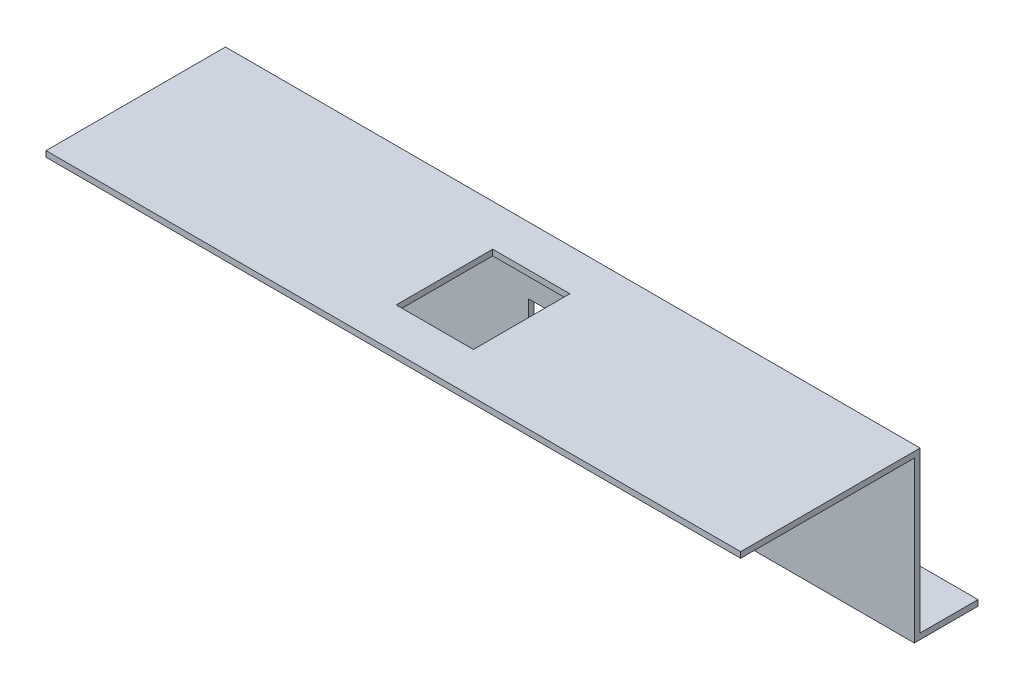
ISO-10303-21;
HEADER;
FILE_DESCRIPTION(('STEP AP214'),'2;1');
FILE_NAME('part.step','',(''),(''),'','','');
FILE_SCHEMA(('AUTOMOTIVE_DESIGN { 1 0 10303 214 1 1 1 1 }'));
ENDSEC;
DATA;
#1=APPLICATION_CONTEXT('core data for automotive mechanical design processes');
#2=APPLICATION_PROTOCOL_DEFINITION('international standard','automotive_design',2000,#1);
#3=PRODUCT_CONTEXT('',#1,'mechanical');
#4=PRODUCT('Part','Part','',(#3));
#5=PRODUCT_RELATED_PRODUCT_CATEGORY('part','',(#4));
#6=PRODUCT_DEFINITION_FORMATION('','',#4);
#7=PRODUCT_DEFINITION_CONTEXT('part definition',#1,'design');
#8=PRODUCT_DEFINITION('design','',#6,#7);
#9=PRODUCT_DEFINITION_SHAPE('','',#8);
#10=(LENGTH_UNIT() NAMED_UNIT(*) SI_UNIT(.MILLI.,.METRE.));
#11=(NAMED_UNIT(*) PLANE_ANGLE_UNIT() SI_UNIT($,.RADIAN.));
#12=(NAMED_UNIT(*) SI_UNIT($,.STERADIAN.) SOLID_ANGLE_UNIT());
#13=UNCERTAINTY_MEASURE_WITH_UNIT(LENGTH_MEASURE(1.E-05),#10,'distance_accuracy_value','');
#14=(GEOMETRIC_REPRESENTATION_CONTEXT(3) GLOBAL_UNCERTAINTY_ASSIGNED_CONTEXT((#13)) GLOBAL_UNIT_ASSIGNED_CONTEXT((#10,
#11,#12)) REPRESENTATION_CONTEXT('',''));
#15=CARTESIAN_POINT('',(0.,0.,0.));
#16=DIRECTION('',(0.,0.,1.));
#17=DIRECTION('',(1.,0.,0.));
#18=AXIS2_PLACEMENT_3D('',#15,#16,#17);
#19=CARTESIAN_POINT('',(180.,40.,45.75));
#20=DIRECTION('',(0.,0.,-1.));
#21=DIRECTION('',(-1.,0.,0.));
#22=AXIS2_PLACEMENT_3D('',#19,#20,#21);
#23=PLANE('',#22);
#24=DIRECTION('',(0.,-1.,0.));
#25=VECTOR('',#24,1.);
#26=CARTESIAN_POINT('',(0.,40.,45.75));
#27=LINE('',#26,#25);
#28=CARTESIAN_POINT('',(0.,41.5,45.75));
#29=VERTEX_POINT('',#28);
#30=CARTESIAN_POINT('',(0.,40.,45.75));
#31=VERTEX_POINT('',#30);
#32=EDGE_CURVE('E243',#29,#31,#27,.T.);
#33=ORIENTED_EDGE('',*,*,#32,.T.);
#34=DIRECTION('',(-1.,0.,0.));
#35=VECTOR('',#34,1.);
#36=CARTESIAN_POINT('',(180.,40.,45.75));
#37=LINE('',#36,#35);
#38=CARTESIAN_POINT('',(180.,40.,45.75));
#39=VERTEX_POINT('',#38);
#40=EDGE_CURVE('E11',#39,#31,#37,.T.);
#41=ORIENTED_EDGE('',*,*,#40,.F.);
#42=DIRECTION('',(0.,-1.,0.));
#43=VECTOR('',#42,1.);
#44=CARTESIAN_POINT('',(180.,40.,45.75));
#45=LINE('',#44,#43);
#46=CARTESIAN_POINT('',(180.,41.5,45.75));
#47=VERTEX_POINT('',#46);
#48=EDGE_CURVE('E244',#47,#39,#45,.T.);
#49=ORIENTED_EDGE('',*,*,#48,.F.);
#50=DIRECTION('',(-1.,0.,0.));
#51=VECTOR('',#50,1.);
#52=CARTESIAN_POINT('',(180.,41.5,45.75));
#53=LINE('',#52,#51);
#54=EDGE_CURVE('E262',#47,#29,#53,.T.);
#55=ORIENTED_EDGE('',*,*,#54,.T.);
#56=EDGE_LOOP('',(#33,#41,#49,#55));
#57=FACE_BOUND('',#56,.T.);
#58=ADVANCED_FACE('F32',(#57),#23,.F.);
#59=CARTESIAN_POINT('',(180.,40.,0.750000000000001));
#60=DIRECTION('',(0.,1.,0.));
#61=DIRECTION('',(0.,0.,1.));
#62=AXIS2_PLACEMENT_3D('',#59,#60,#61);
#63=PLANE('',#62);
#64=DIRECTION('',(1.,0.,0.));
#65=VECTOR('',#64,1.);
#66=CARTESIAN_POINT('',(180.,40.,35.));
#67=LINE('',#66,#65);
#68=CARTESIAN_POINT('',(80.,40.,35.));
#69=VERTEX_POINT('',#68);
#70=CARTESIAN_POINT('',(100.,40.,35.));
#71=VERTEX_POINT('',#70);
#72=EDGE_CURVE('E175',#69,#71,#67,.T.);
#73=ORIENTED_EDGE('',*,*,#72,.T.);
#74=DIRECTION('',(0.,0.,-1.));
#75=VECTOR('',#74,1.);
#76=CARTESIAN_POINT('',(100.,40.,0.750000000000001));
#77=LINE('',#76,#75);
#78=CARTESIAN_POINT('',(100.,40.,9.99999999999997));
#79=VERTEX_POINT('',#78);
#80=EDGE_CURVE('E178',#71,#79,#77,.T.);
#81=ORIENTED_EDGE('',*,*,#80,.T.);
#82=DIRECTION('',(-1.,0.,0.));
#83=VECTOR('',#82,1.);
#84=CARTESIAN_POINT('',(180.,40.,9.99999999999997));
#85=LINE('',#84,#83);
#86=CARTESIAN_POINT('',(80.,40.,9.99999999999997));
#87=VERTEX_POINT('',#86);
#88=EDGE_CURVE('E170',#79,#87,#85,.T.);
#89=ORIENTED_EDGE('',*,*,#88,.T.);
#90=DIRECTION('',(0.,0.,1.));
#91=VECTOR('',#90,1.);
#92=CARTESIAN_POINT('',(80.,40.,0.750000000000001));
#93=LINE('',#92,#91);
#94=EDGE_CURVE('E150',#87,#69,#93,.T.);
#95=ORIENTED_EDGE('',*,*,#94,.T.);
#96=EDGE_LOOP('',(#73,#81,#89,#95));
#97=FACE_BOUND('',#96,.T.);
#98=DIRECTION('',(0.,0.,-1.));
#99=VECTOR('',#98,1.);
#100=CARTESIAN_POINT('',(0.,40.,0.750000000000001));
#101=LINE('',#100,#99);
#102=CARTESIAN_POINT('',(0.,40.,0.750000000000001));
#103=VERTEX_POINT('',#102);
#104=EDGE_CURVE('E265',#31,#103,#101,.T.);
#105=ORIENTED_EDGE('',*,*,#104,.T.);
#106=DIRECTION('',(-1.,0.,0.));
#107=VECTOR('',#106,1.);
#108=CARTESIAN_POINT('',(180.,40.,0.750000000000001));
#109=LINE('',#108,#107);
#110=CARTESIAN_POINT('',(180.,40.,0.750000000000001));
#111=VERTEX_POINT('',#110);
#112=EDGE_CURVE('E39',#111,#103,#109,.T.);
#113=ORIENTED_EDGE('',*,*,#112,.F.);
#114=DIRECTION('',(0.,0.,-1.));
#115=VECTOR('',#114,1.);
#116=CARTESIAN_POINT('',(180.,40.,0.750000000000001));
#117=LINE('',#116,#115);
#118=EDGE_CURVE('E247',#39,#111,#117,.T.);
#119=ORIENTED_EDGE('',*,*,#118,.F.);
#120=ORIENTED_EDGE('',*,*,#40,.T.);
#121=EDGE_LOOP('',(#105,#113,#119,#120));
#122=FACE_BOUND('',#121,.T.);
#123=ADVANCED_FACE('F302',(#97,#122),#63,.F.);
#124=CARTESIAN_POINT('',(180.,-1.5,0.750000000000001));
#125=DIRECTION('',(0.,0.,-1.));
#126=DIRECTION('',(-1.,0.,0.));
#127=AXIS2_PLACEMENT_3D('',#124,#125,#126);
#128=PLANE('',#127);
#129=DIRECTION('',(-1.,0.,0.));
#130=VECTOR('',#129,1.);
#131=CARTESIAN_POINT('',(180.,15.75,0.750000000000001));
#132=LINE('',#131,#130);
#133=CARTESIAN_POINT('',(100.,15.75,0.750000000000001));
#134=VERTEX_POINT('',#133);
#135=CARTESIAN_POINT('',(80.,15.75,0.750000000000001));
#136=VERTEX_POINT('',#135);
#137=EDGE_CURVE('E207',#134,#136,#132,.T.);
#138=ORIENTED_EDGE('',*,*,#137,.T.);
#139=DIRECTION('',(0.,1.,0.));
#140=VECTOR('',#139,1.);
#141=CARTESIAN_POINT('',(80.,-1.5,0.750000000000001));
#142=LINE('',#141,#140);
#143=CARTESIAN_POINT('',(80.,25.75,0.750000000000001));
#144=VERTEX_POINT('',#143);
#145=EDGE_CURVE('E210',#136,#144,#142,.T.);
#146=ORIENTED_EDGE('',*,*,#145,.T.);
#147=DIRECTION('',(1.,0.,0.));
#148=VECTOR('',#147,1.);
#149=CARTESIAN_POINT('',(180.,25.75,0.750000000000001));
#150=LINE('',#149,#148);
#151=CARTESIAN_POINT('',(100.,25.75,0.750000000000001));
#152=VERTEX_POINT('',#151);
#153=EDGE_CURVE('E195',#144,#152,#150,.T.);
#154=ORIENTED_EDGE('',*,*,#153,.T.);
#155=DIRECTION('',(0.,-1.,0.));
#156=VECTOR('',#155,1.);
#157=CARTESIAN_POINT('',(100.,-1.5,0.750000000000001));
#158=LINE('',#157,#156);
#159=EDGE_CURVE('E204',#152,#134,#158,.T.);
#160=ORIENTED_EDGE('',*,*,#159,.T.);
#161=EDGE_LOOP('',(#138,#146,#154,#160));
#162=FACE_BOUND('',#161,.T.);
#163=DIRECTION('',(0.,-1.,0.));
#164=VECTOR('',#163,1.);
#165=CARTESIAN_POINT('',(0.,-1.5,0.750000000000001));
#166=LINE('',#165,#164);
#167=CARTESIAN_POINT('',(0.,-1.5,0.750000000000001));
#168=VERTEX_POINT('',#167);
#169=EDGE_CURVE('E268',#103,#168,#166,.T.);
#170=ORIENTED_EDGE('',*,*,#169,.T.);
#171=DIRECTION('',(-1.,0.,0.));
#172=VECTOR('',#171,1.);
#173=CARTESIAN_POINT('',(180.,-1.5,0.750000000000001));
#174=LINE('',#173,#172);
#175=CARTESIAN_POINT('',(180.,-1.5,0.750000000000001));
#176=VERTEX_POINT('',#175);
#177=EDGE_CURVE('E293',#176,#168,#174,.T.);
#178=ORIENTED_EDGE('',*,*,#177,.F.);
#179=DIRECTION('',(0.,-1.,0.));
#180=VECTOR('',#179,1.);
#181=CARTESIAN_POINT('',(180.,0.,0.750000000000001));
#182=LINE('',#181,#180);
#183=EDGE_CURVE('E250',#111,#176,#182,.T.);
#184=ORIENTED_EDGE('',*,*,#183,.F.);
#185=ORIENTED_EDGE('',*,*,#112,.T.);
#186=EDGE_LOOP('',(#170,#178,#184,#185));
#187=FACE_BOUND('',#186,.T.);
#188=ADVANCED_FACE('F299',(#162,#187),#128,.F.);
#189=CARTESIAN_POINT('',(180.,-1.5,-15.75));
#190=DIRECTION('',(0.,1.,0.));
#191=DIRECTION('',(0.,0.,1.));
#192=AXIS2_PLACEMENT_3D('',#189,#190,#191);
#193=PLANE('',#192);
#194=CARTESIAN_POINT('',(90.,-1.5,-8.24999999999998));
#195=DIRECTION('',(0.,1.,0.));
#196=DIRECTION('',(0.,0.,1.));
#197=AXIS2_PLACEMENT_3D('',#194,#195,#196);
#198=CIRCLE('',#197,1.5);
#199=CARTESIAN_POINT('',(90.,-1.5,-6.74999999999998));
#200=VERTEX_POINT('',#199);
#201=EDGE_CURVE('E234',#200,#200,#198,.T.);
#202=ORIENTED_EDGE('',*,*,#201,.T.);
#203=EDGE_LOOP('',(#202));
#204=FACE_BOUND('',#203,.T.);
#205=CARTESIAN_POINT('',(150.,-1.5,-8.25000000000081));
#206=DIRECTION('',(0.,1.,0.));
#207=DIRECTION('',(0.,0.,1.));
#208=AXIS2_PLACEMENT_3D('',#205,#206,#207);
#209=CIRCLE('',#208,1.5);
#210=CARTESIAN_POINT('',(150.,-1.5,-6.75000000000082));
#211=VERTEX_POINT('',#210);
#212=EDGE_CURVE('E231',#211,#211,#209,.T.);
#213=ORIENTED_EDGE('',*,*,#212,.T.);
#214=EDGE_LOOP('',(#213));
#215=FACE_BOUND('',#214,.T.);
#216=CARTESIAN_POINT('',(60.,-1.5,-8.24999999999977));
#217=DIRECTION('',(0.,1.,0.));
#218=DIRECTION('',(0.,0.,1.));
#219=AXIS2_PLACEMENT_3D('',#216,#217,#218);
#220=CIRCLE('',#219,1.5);
#221=CARTESIAN_POINT('',(60.,-1.5,-6.74999999999977));
#222=VERTEX_POINT('',#221);
#223=EDGE_CURVE('E228',#222,#222,#220,.T.);
#224=ORIENTED_EDGE('',*,*,#223,.T.);
#225=EDGE_LOOP('',(#224));
#226=FACE_BOUND('',#225,.T.);
#227=CARTESIAN_POINT('',(30.,-1.5,-8.24999999999956));
#228=DIRECTION('',(0.,1.,0.));
#229=DIRECTION('',(0.,0.,1.));
#230=AXIS2_PLACEMENT_3D('',#227,#228,#229);
#231=CIRCLE('',#230,1.5);
#232=CARTESIAN_POINT('',(30.,-1.5,-6.74999999999956));
#233=VERTEX_POINT('',#232);
#234=EDGE_CURVE('E217',#233,#233,#231,.T.);
#235=ORIENTED_EDGE('',*,*,#234,.T.);
#236=EDGE_LOOP('',(#235));
#237=FACE_BOUND('',#236,.T.);
#238=CARTESIAN_POINT('',(120.,-1.5,-8.2500000000004));
#239=DIRECTION('',(0.,1.,0.));
#240=DIRECTION('',(0.,0.,1.));
#241=AXIS2_PLACEMENT_3D('',#238,#239,#240);
#242=CIRCLE('',#241,1.5);
#243=CARTESIAN_POINT('',(120.,-1.5,-6.7500000000004));
#244=VERTEX_POINT('',#243);
#245=EDGE_CURVE('E240',#244,#244,#242,.T.);
#246=ORIENTED_EDGE('',*,*,#245,.T.);
#247=EDGE_LOOP('',(#246));
#248=FACE_BOUND('',#247,.T.);
#249=DIRECTION('',(0.,0.,-1.));
#250=VECTOR('',#249,1.);
#251=CARTESIAN_POINT('',(0.,-1.5,-15.75));
#252=LINE('',#251,#250);
#253=CARTESIAN_POINT('',(0.,-1.5,-15.75));
#254=VERTEX_POINT('',#253);
#255=EDGE_CURVE('E270',#168,#254,#252,.T.);
#256=ORIENTED_EDGE('',*,*,#255,.T.);
#257=DIRECTION('',(-1.,0.,0.));
#258=VECTOR('',#257,1.);
#259=CARTESIAN_POINT('',(180.,-1.5,-15.75));
#260=LINE('',#259,#258);
#261=CARTESIAN_POINT('',(180.,-1.5,-15.75));
#262=VERTEX_POINT('',#261);
#263=EDGE_CURVE('E290',#262,#254,#260,.T.);
#264=ORIENTED_EDGE('',*,*,#263,.F.);
#265=DIRECTION('',(0.,0.,-1.));
#266=VECTOR('',#265,1.);
#267=CARTESIAN_POINT('',(180.,-1.5,-15.75));
#268=LINE('',#267,#266);
#269=EDGE_CURVE('E252',#176,#262,#268,.T.);
#270=ORIENTED_EDGE('',*,*,#269,.F.);
#271=ORIENTED_EDGE('',*,*,#177,.T.);
#272=EDGE_LOOP('',(#256,#264,#270,#271));
#273=FACE_BOUND('',#272,.T.);
#274=ADVANCED_FACE('F313',(#204,#215,#226,#237,#248,#273),#193,.F.);
#275=CARTESIAN_POINT('',(180.,0.,-15.75));
#276=DIRECTION('',(0.,0.,1.));
#277=DIRECTION('',(1.,0.,0.));
#278=AXIS2_PLACEMENT_3D('',#275,#276,#277);
#279=PLANE('',#278);
#280=DIRECTION('',(0.,1.,0.));
#281=VECTOR('',#280,1.);
#282=CARTESIAN_POINT('',(0.,0.,-15.75));
#283=LINE('',#282,#281);
#284=CARTESIAN_POINT('',(0.,0.,-15.75));
#285=VERTEX_POINT('',#284);
#286=EDGE_CURVE('E272',#254,#285,#283,.T.);
#287=ORIENTED_EDGE('',*,*,#286,.T.);
#288=DIRECTION('',(-1.,0.,0.));
#289=VECTOR('',#288,1.);
#290=CARTESIAN_POINT('',(180.,0.,-15.75));
#291=LINE('',#290,#289);
#292=CARTESIAN_POINT('',(180.,0.,-15.75));
#293=VERTEX_POINT('',#292);
#294=EDGE_CURVE('E287',#293,#285,#291,.T.);
#295=ORIENTED_EDGE('',*,*,#294,.F.);
#296=DIRECTION('',(0.,1.,0.));
#297=VECTOR('',#296,1.);
#298=CARTESIAN_POINT('',(180.,0.,-15.75));
#299=LINE('',#298,#297);
#300=EDGE_CURVE('E254',#262,#293,#299,.T.);
#301=ORIENTED_EDGE('',*,*,#300,.F.);
#302=ORIENTED_EDGE('',*,*,#263,.T.);
#303=EDGE_LOOP('',(#287,#295,#301,#302));
#304=FACE_BOUND('',#303,.T.);
#305=ADVANCED_FACE('F317',(#304),#279,.F.);
#306=CARTESIAN_POINT('',(180.,0.,-0.750000000000001));
#307=DIRECTION('',(0.,-1.,0.));
#308=DIRECTION('',(0.,0.,-1.));
#309=AXIS2_PLACEMENT_3D('',#306,#307,#308);
#310=PLANE('',#309);
#311=CARTESIAN_POINT('',(90.,0.,-8.24999999999998));
#312=DIRECTION('',(0.,1.,0.));
#313=DIRECTION('',(0.,0.,1.));
#314=AXIS2_PLACEMENT_3D('',#311,#312,#313);
#315=CIRCLE('',#314,1.5);
#316=CARTESIAN_POINT('',(90.,0.,-6.74999999999998));
#317=VERTEX_POINT('',#316);
#318=EDGE_CURVE('E214',#317,#317,#315,.T.);
#319=ORIENTED_EDGE('',*,*,#318,.F.);
#320=EDGE_LOOP('',(#319));
#321=FACE_BOUND('',#320,.T.);
#322=CARTESIAN_POINT('',(150.,0.,-8.25000000000081));
#323=DIRECTION('',(0.,1.,0.));
#324=DIRECTION('',(0.,0.,1.));
#325=AXIS2_PLACEMENT_3D('',#322,#323,#324);
#326=CIRCLE('',#325,1.5);
#327=CARTESIAN_POINT('',(150.,0.,-6.75000000000082));
#328=VERTEX_POINT('',#327);
#329=EDGE_CURVE('E218',#328,#328,#326,.T.);
#330=ORIENTED_EDGE('',*,*,#329,.F.);
#331=EDGE_LOOP('',(#330));
#332=FACE_BOUND('',#331,.T.);
#333=CARTESIAN_POINT('',(60.,0.,-8.24999999999977));
#334=DIRECTION('',(0.,1.,0.));
#335=DIRECTION('',(0.,0.,1.));
#336=AXIS2_PLACEMENT_3D('',#333,#334,#335);
#337=CIRCLE('',#336,1.5);
#338=CARTESIAN_POINT('',(60.,0.,-6.74999999999977));
#339=VERTEX_POINT('',#338);
#340=EDGE_CURVE('E221',#339,#339,#337,.T.);
#341=ORIENTED_EDGE('',*,*,#340,.F.);
#342=EDGE_LOOP('',(#341));
#343=FACE_BOUND('',#342,.T.);
#344=CARTESIAN_POINT('',(30.,0.,-8.24999999999956));
#345=DIRECTION('',(0.,1.,0.));
#346=DIRECTION('',(0.,0.,1.));
#347=AXIS2_PLACEMENT_3D('',#344,#345,#346);
#348=CIRCLE('',#347,1.5);
#349=CARTESIAN_POINT('',(30.,0.,-6.74999999999956));
#350=VERTEX_POINT('',#349);
#351=EDGE_CURVE('E213',#350,#350,#348,.T.);
#352=ORIENTED_EDGE('',*,*,#351,.F.);
#353=EDGE_LOOP('',(#352));
#354=FACE_BOUND('',#353,.T.);
#355=CARTESIAN_POINT('',(120.,0.,-8.2500000000004));
#356=DIRECTION('',(0.,1.,0.));
#357=DIRECTION('',(0.,0.,1.));
#358=AXIS2_PLACEMENT_3D('',#355,#356,#357);
#359=CIRCLE('',#358,1.5);
#360=CARTESIAN_POINT('',(120.,0.,-6.7500000000004));
#361=VERTEX_POINT('',#360);
#362=EDGE_CURVE('E237',#361,#361,#359,.T.);
#363=ORIENTED_EDGE('',*,*,#362,.F.);
#364=EDGE_LOOP('',(#363));
#365=FACE_BOUND('',#364,.T.);
#366=DIRECTION('',(0.,0.,1.));
#367=VECTOR('',#366,1.);
#368=CARTESIAN_POINT('',(0.,0.,-0.750000000000001));
#369=LINE('',#368,#367);
#370=CARTESIAN_POINT('',(0.,0.,-0.750000000000001));
#371=VERTEX_POINT('',#370);
#372=EDGE_CURVE('E274',#285,#371,#369,.T.);
#373=ORIENTED_EDGE('',*,*,#372,.T.);
#374=DIRECTION('',(-1.,0.,0.));
#375=VECTOR('',#374,1.);
#376=CARTESIAN_POINT('',(180.,0.,-0.750000000000001));
#377=LINE('',#376,#375);
#378=CARTESIAN_POINT('',(180.,0.,-0.750000000000001));
#379=VERTEX_POINT('',#378);
#380=EDGE_CURVE('E284',#379,#371,#377,.T.);
#381=ORIENTED_EDGE('',*,*,#380,.F.);
#382=DIRECTION('',(0.,0.,1.));
#383=VECTOR('',#382,1.);
#384=CARTESIAN_POINT('',(180.,0.,-0.750000000000001));
#385=LINE('',#384,#383);
#386=EDGE_CURVE('E256',#293,#379,#385,.T.);
#387=ORIENTED_EDGE('',*,*,#386,.F.);
#388=ORIENTED_EDGE('',*,*,#294,.T.);
#389=EDGE_LOOP('',(#373,#381,#387,#388));
#390=FACE_BOUND('',#389,.T.);
#391=ADVANCED_FACE('F333',(#321,#332,#343,#354,#365,#390),#310,.F.);
#392=CARTESIAN_POINT('',(180.,41.5,-0.749999999999994));
#393=DIRECTION('',(0.,0.,1.));
#394=DIRECTION('',(0.,-1.,0.));
#395=AXIS2_PLACEMENT_3D('',#392,#393,#394);
#396=PLANE('',#395);
#397=DIRECTION('',(1.,0.,0.));
#398=VECTOR('',#397,1.);
#399=CARTESIAN_POINT('',(100.,25.75,-0.749999999999996));
#400=LINE('',#399,#398);
#401=CARTESIAN_POINT('',(80.,25.75,-0.749999999999996));
#402=VERTEX_POINT('',#401);
#403=CARTESIAN_POINT('',(100.,25.75,-0.749999999999996));
#404=VERTEX_POINT('',#403);
#405=EDGE_CURVE('E183',#402,#404,#400,.T.);
#406=ORIENTED_EDGE('',*,*,#405,.F.);
#407=DIRECTION('',(0.,1.,0.));
#408=VECTOR('',#407,1.);
#409=CARTESIAN_POINT('',(80.,25.75,-0.749999999999996));
#410=LINE('',#409,#408);
#411=CARTESIAN_POINT('',(80.,15.75,-0.749999999999998));
#412=VERTEX_POINT('',#411);
#413=EDGE_CURVE('E181',#412,#402,#410,.T.);
#414=ORIENTED_EDGE('',*,*,#413,.F.);
#415=DIRECTION('',(-1.,0.,0.));
#416=VECTOR('',#415,1.);
#417=CARTESIAN_POINT('',(100.,15.75,-0.749999999999998));
#418=LINE('',#417,#416);
#419=CARTESIAN_POINT('',(100.,15.75,-0.749999999999998));
#420=VERTEX_POINT('',#419);
#421=EDGE_CURVE('E189',#420,#412,#418,.T.);
#422=ORIENTED_EDGE('',*,*,#421,.F.);
#423=DIRECTION('',(0.,-1.,0.));
#424=VECTOR('',#423,1.);
#425=CARTESIAN_POINT('',(100.,25.75,-0.749999999999996));
#426=LINE('',#425,#424);
#427=EDGE_CURVE('E186',#404,#420,#426,.T.);
#428=ORIENTED_EDGE('',*,*,#427,.F.);
#429=EDGE_LOOP('',(#406,#414,#422,#428));
#430=FACE_BOUND('',#429,.T.);
#431=DIRECTION('',(0.,1.,0.));
#432=VECTOR('',#431,1.);
#433=CARTESIAN_POINT('',(0.,41.5,-0.749999999999994));
#434=LINE('',#433,#432);
#435=CARTESIAN_POINT('',(0.,41.5,-0.749999999999994));
#436=VERTEX_POINT('',#435);
#437=EDGE_CURVE('E276',#371,#436,#434,.T.);
#438=ORIENTED_EDGE('',*,*,#437,.T.);
#439=DIRECTION('',(-1.,0.,0.));
#440=VECTOR('',#439,1.);
#441=CARTESIAN_POINT('',(180.,41.5,-0.749999999999994));
#442=LINE('',#441,#440);
#443=CARTESIAN_POINT('',(180.,41.5,-0.749999999999994));
#444=VERTEX_POINT('',#443);
#445=EDGE_CURVE('E281',#444,#436,#442,.T.);
#446=ORIENTED_EDGE('',*,*,#445,.F.);
#447=DIRECTION('',(0.,1.,0.));
#448=VECTOR('',#447,1.);
#449=CARTESIAN_POINT('',(180.,41.5,-0.749999999999994));
#450=LINE('',#449,#448);
#451=EDGE_CURVE('E258',#379,#444,#450,.T.);
#452=ORIENTED_EDGE('',*,*,#451,.F.);
#453=ORIENTED_EDGE('',*,*,#380,.T.);
#454=EDGE_LOOP('',(#438,#446,#452,#453));
#455=FACE_BOUND('',#454,.T.);
#456=ADVANCED_FACE('F330',(#430,#455),#396,.F.);
#457=CARTESIAN_POINT('',(180.,41.5,45.75));
#458=DIRECTION('',(0.,-1.,0.));
#459=DIRECTION('',(0.,0.,-1.));
#460=AXIS2_PLACEMENT_3D('',#457,#458,#459);
#461=PLANE('',#460);
#462=DIRECTION('',(-1.,0.,0.));
#463=VECTOR('',#462,1.);
#464=CARTESIAN_POINT('',(80.,41.5,9.99999999999997));
#465=LINE('',#464,#463);
#466=CARTESIAN_POINT('',(100.,41.5,9.99999999999997));
#467=VERTEX_POINT('',#466);
#468=CARTESIAN_POINT('',(80.,41.5,9.99999999999997));
#469=VERTEX_POINT('',#468);
#470=EDGE_CURVE('E156',#467,#469,#465,.T.);
#471=ORIENTED_EDGE('',*,*,#470,.F.);
#472=DIRECTION('',(0.,0.,-1.));
#473=VECTOR('',#472,1.);
#474=CARTESIAN_POINT('',(100.,41.5,9.99999999999997));
#475=LINE('',#474,#473);
#476=CARTESIAN_POINT('',(100.,41.5,35.));
#477=VERTEX_POINT('',#476);
#478=EDGE_CURVE('E54',#477,#467,#475,.T.);
#479=ORIENTED_EDGE('',*,*,#478,.F.);
#480=DIRECTION('',(1.,0.,0.));
#481=VECTOR('',#480,1.);
#482=CARTESIAN_POINT('',(80.,41.5,35.));
#483=LINE('',#482,#481);
#484=CARTESIAN_POINT('',(80.,41.5,35.));
#485=VERTEX_POINT('',#484);
#486=EDGE_CURVE('E163',#485,#477,#483,.T.);
#487=ORIENTED_EDGE('',*,*,#486,.F.);
#488=DIRECTION('',(0.,0.,1.));
#489=VECTOR('',#488,1.);
#490=CARTESIAN_POINT('',(80.,41.5,9.99999999999997));
#491=LINE('',#490,#489);
#492=EDGE_CURVE('E147',#469,#485,#491,.T.);
#493=ORIENTED_EDGE('',*,*,#492,.F.);
#494=EDGE_LOOP('',(#471,#479,#487,#493));
#495=FACE_BOUND('',#494,.T.);
#496=DIRECTION('',(0.,0.,1.));
#497=VECTOR('',#496,1.);
#498=CARTESIAN_POINT('',(0.,41.5,45.75));
#499=LINE('',#498,#497);
#500=EDGE_CURVE('E248',#436,#29,#499,.T.);
#501=ORIENTED_EDGE('',*,*,#500,.T.);
#502=ORIENTED_EDGE('',*,*,#54,.F.);
#503=DIRECTION('',(0.,0.,1.));
#504=VECTOR('',#503,1.);
#505=CARTESIAN_POINT('',(180.,41.5,45.75));
#506=LINE('',#505,#504);
#507=EDGE_CURVE('E260',#444,#47,#506,.T.);
#508=ORIENTED_EDGE('',*,*,#507,.F.);
#509=ORIENTED_EDGE('',*,*,#445,.T.);
#510=EDGE_LOOP('',(#501,#502,#508,#509));
#511=FACE_BOUND('',#510,.T.);
#512=ADVANCED_FACE('F160',(#495,#511),#461,.F.);
#513=CARTESIAN_POINT('',(180.,0.,0.));
#514=DIRECTION('',(-1.,0.,0.));
#515=DIRECTION('',(0.,0.,1.));
#516=AXIS2_PLACEMENT_3D('',#513,#514,#515);
#517=PLANE('',#516);
#518=ORIENTED_EDGE('',*,*,#48,.T.);
#519=ORIENTED_EDGE('',*,*,#118,.T.);
#520=ORIENTED_EDGE('',*,*,#183,.T.);
#521=ORIENTED_EDGE('',*,*,#269,.T.);
#522=ORIENTED_EDGE('',*,*,#300,.T.);
#523=ORIENTED_EDGE('',*,*,#386,.T.);
#524=ORIENTED_EDGE('',*,*,#451,.T.);
#525=ORIENTED_EDGE('',*,*,#507,.T.);
#526=EDGE_LOOP('',(#518,#519,#520,#521,#522,#523,#524,#525));
#527=FACE_BOUND('',#526,.T.);
#528=ADVANCED_FACE('F321',(#527),#517,.F.);
#529=CARTESIAN_POINT('',(0.,0.,0.));
#530=DIRECTION('',(-1.,0.,0.));
#531=DIRECTION('',(0.,0.,1.));
#532=AXIS2_PLACEMENT_3D('',#529,#530,#531);
#533=PLANE('',#532);
#534=ORIENTED_EDGE('',*,*,#32,.F.);
#535=ORIENTED_EDGE('',*,*,#500,.F.);
#536=ORIENTED_EDGE('',*,*,#437,.F.);
#537=ORIENTED_EDGE('',*,*,#372,.F.);
#538=ORIENTED_EDGE('',*,*,#286,.F.);
#539=ORIENTED_EDGE('',*,*,#255,.F.);
#540=ORIENTED_EDGE('',*,*,#169,.F.);
#541=ORIENTED_EDGE('',*,*,#104,.F.);
#542=EDGE_LOOP('',(#534,#535,#536,#537,#538,#539,#540,#541));
#543=FACE_BOUND('',#542,.T.);
#544=ADVANCED_FACE('F306',(#543),#533,.T.);
#545=CARTESIAN_POINT('',(120.,-10.,-8.2500000000004));
#546=DIRECTION('',(0.,1.,0.));
#547=DIRECTION('',(0.,0.,1.));
#548=AXIS2_PLACEMENT_3D('',#545,#546,#547);
#549=CYLINDRICAL_SURFACE('',#548,1.5);
#550=ORIENTED_EDGE('',*,*,#362,.T.);
#551=EDGE_LOOP('',(#550));
#552=FACE_BOUND('',#551,.T.);
#553=ORIENTED_EDGE('',*,*,#245,.F.);
#554=EDGE_LOOP('',(#553));
#555=FACE_BOUND('',#554,.T.);
#556=ADVANCED_FACE('F371',(#552,#555),#549,.F.);
#557=CARTESIAN_POINT('',(30.,-10.,-8.24999999999956));
#558=DIRECTION('',(0.,1.,0.));
#559=DIRECTION('',(0.,0.,1.));
#560=AXIS2_PLACEMENT_3D('',#557,#558,#559);
#561=CYLINDRICAL_SURFACE('',#560,1.5);
#562=ORIENTED_EDGE('',*,*,#351,.T.);
#563=EDGE_LOOP('',(#562));
#564=FACE_BOUND('',#563,.T.);
#565=ORIENTED_EDGE('',*,*,#234,.F.);
#566=EDGE_LOOP('',(#565));
#567=FACE_BOUND('',#566,.T.);
#568=ADVANCED_FACE('F373',(#564,#567),#561,.F.);
#569=CARTESIAN_POINT('',(60.,-10.,-8.24999999999977));
#570=DIRECTION('',(0.,1.,0.));
#571=DIRECTION('',(0.,0.,1.));
#572=AXIS2_PLACEMENT_3D('',#569,#570,#571);
#573=CYLINDRICAL_SURFACE('',#572,1.5);
#574=ORIENTED_EDGE('',*,*,#340,.T.);
#575=EDGE_LOOP('',(#574));
#576=FACE_BOUND('',#575,.T.);
#577=ORIENTED_EDGE('',*,*,#223,.F.);
#578=EDGE_LOOP('',(#577));
#579=FACE_BOUND('',#578,.T.);
#580=ADVANCED_FACE('F380',(#576,#579),#573,.F.);
#581=CARTESIAN_POINT('',(150.,-10.,-8.25000000000081));
#582=DIRECTION('',(0.,1.,0.));
#583=DIRECTION('',(0.,0.,1.));
#584=AXIS2_PLACEMENT_3D('',#581,#582,#583);
#585=CYLINDRICAL_SURFACE('',#584,1.5);
#586=ORIENTED_EDGE('',*,*,#329,.T.);
#587=EDGE_LOOP('',(#586));
#588=FACE_BOUND('',#587,.T.);
#589=ORIENTED_EDGE('',*,*,#212,.F.);
#590=EDGE_LOOP('',(#589));
#591=FACE_BOUND('',#590,.T.);
#592=ADVANCED_FACE('F433',(#588,#591),#585,.F.);
#593=CARTESIAN_POINT('',(90.,-10.,-8.24999999999998));
#594=DIRECTION('',(0.,1.,0.));
#595=DIRECTION('',(0.,0.,1.));
#596=AXIS2_PLACEMENT_3D('',#593,#594,#595);
#597=CYLINDRICAL_SURFACE('',#596,1.5);
#598=ORIENTED_EDGE('',*,*,#318,.T.);
#599=EDGE_LOOP('',(#598));
#600=FACE_BOUND('',#599,.T.);
#601=ORIENTED_EDGE('',*,*,#201,.F.);
#602=EDGE_LOOP('',(#601));
#603=FACE_BOUND('',#602,.T.);
#604=ADVANCED_FACE('F442',(#600,#603),#597,.F.);
#605=CARTESIAN_POINT('',(80.,25.75,9.25000000000001));
#606=DIRECTION('',(-1.,0.,0.));
#607=DIRECTION('',(0.,0.,1.));
#608=AXIS2_PLACEMENT_3D('',#605,#606,#607);
#609=PLANE('',#608);
#610=DIRECTION('',(0.,0.,-1.));
#611=VECTOR('',#610,1.);
#612=CARTESIAN_POINT('',(80.,15.75,9.25));
#613=LINE('',#612,#611);
#614=EDGE_CURVE('E193',#136,#412,#613,.T.);
#615=ORIENTED_EDGE('',*,*,#614,.T.);
#616=ORIENTED_EDGE('',*,*,#413,.T.);
#617=DIRECTION('',(0.,0.,-1.));
#618=VECTOR('',#617,1.);
#619=CARTESIAN_POINT('',(80.,25.75,9.25000000000001));
#620=LINE('',#619,#618);
#621=EDGE_CURVE('E192',#144,#402,#620,.T.);
#622=ORIENTED_EDGE('',*,*,#621,.F.);
#623=ORIENTED_EDGE('',*,*,#145,.F.);
#624=EDGE_LOOP('',(#615,#616,#622,#623));
#625=FACE_BOUND('',#624,.T.);
#626=ADVANCED_FACE('F452',(#625),#609,.F.);
#627=CARTESIAN_POINT('',(100.,15.75,9.25));
#628=DIRECTION('',(0.,-1.,0.));
#629=DIRECTION('',(0.,0.,-1.));
#630=AXIS2_PLACEMENT_3D('',#627,#628,#629);
#631=PLANE('',#630);
#632=DIRECTION('',(0.,0.,-1.));
#633=VECTOR('',#632,1.);
#634=CARTESIAN_POINT('',(100.,15.75,9.25));
#635=LINE('',#634,#633);
#636=EDGE_CURVE('E196',#134,#420,#635,.T.);
#637=ORIENTED_EDGE('',*,*,#636,.T.);
#638=ORIENTED_EDGE('',*,*,#421,.T.);
#639=ORIENTED_EDGE('',*,*,#614,.F.);
#640=ORIENTED_EDGE('',*,*,#137,.F.);
#641=EDGE_LOOP('',(#637,#638,#639,#640));
#642=FACE_BOUND('',#641,.T.);
#643=ADVANCED_FACE('F471',(#642),#631,.F.);
#644=CARTESIAN_POINT('',(100.,25.75,9.25000000000001));
#645=DIRECTION('',(1.,0.,0.));
#646=DIRECTION('',(0.,0.,-1.));
#647=AXIS2_PLACEMENT_3D('',#644,#645,#646);
#648=PLANE('',#647);
#649=DIRECTION('',(0.,0.,-1.));
#650=VECTOR('',#649,1.);
#651=CARTESIAN_POINT('',(100.,25.75,9.25000000000001));
#652=LINE('',#651,#650);
#653=EDGE_CURVE('E198',#152,#404,#652,.T.);
#654=ORIENTED_EDGE('',*,*,#653,.T.);
#655=ORIENTED_EDGE('',*,*,#427,.T.);
#656=ORIENTED_EDGE('',*,*,#636,.F.);
#657=ORIENTED_EDGE('',*,*,#159,.F.);
#658=EDGE_LOOP('',(#654,#655,#656,#657));
#659=FACE_BOUND('',#658,.T.);
#660=ADVANCED_FACE('F481',(#659),#648,.F.);
#661=CARTESIAN_POINT('',(100.,25.75,9.25000000000001));
#662=DIRECTION('',(0.,1.,0.));
#663=DIRECTION('',(0.,0.,1.));
#664=AXIS2_PLACEMENT_3D('',#661,#662,#663);
#665=PLANE('',#664);
#666=ORIENTED_EDGE('',*,*,#621,.T.);
#667=ORIENTED_EDGE('',*,*,#405,.T.);
#668=ORIENTED_EDGE('',*,*,#653,.F.);
#669=ORIENTED_EDGE('',*,*,#153,.F.);
#670=EDGE_LOOP('',(#666,#667,#668,#669));
#671=FACE_BOUND('',#670,.T.);
#672=ADVANCED_FACE('F491',(#671),#665,.F.);
#673=CARTESIAN_POINT('',(100.,31.5,9.99999999999997));
#674=DIRECTION('',(1.,0.,0.));
#675=DIRECTION('',(0.,0.,-1.));
#676=AXIS2_PLACEMENT_3D('',#673,#674,#675);
#677=PLANE('',#676);
#678=DIRECTION('',(0.,1.,0.));
#679=VECTOR('',#678,1.);
#680=CARTESIAN_POINT('',(100.,31.5,35.));
#681=LINE('',#680,#679);
#682=EDGE_CURVE('E168',#71,#477,#681,.T.);
#683=ORIENTED_EDGE('',*,*,#682,.T.);
#684=ORIENTED_EDGE('',*,*,#478,.T.);
#685=DIRECTION('',(0.,1.,0.));
#686=VECTOR('',#685,1.);
#687=CARTESIAN_POINT('',(100.,31.5,9.99999999999997));
#688=LINE('',#687,#686);
#689=EDGE_CURVE('E153',#79,#467,#688,.T.);
#690=ORIENTED_EDGE('',*,*,#689,.F.);
#691=ORIENTED_EDGE('',*,*,#80,.F.);
#692=EDGE_LOOP('',(#683,#684,#690,#691));
#693=FACE_BOUND('',#692,.T.);
#694=ADVANCED_FACE('F500',(#693),#677,.F.);
#695=CARTESIAN_POINT('',(80.,31.5,35.));
#696=DIRECTION('',(0.,0.,1.));
#697=DIRECTION('',(1.,0.,0.));
#698=AXIS2_PLACEMENT_3D('',#695,#696,#697);
#699=PLANE('',#698);
#700=DIRECTION('',(0.,1.,0.));
#701=VECTOR('',#700,1.);
#702=CARTESIAN_POINT('',(80.,31.5,35.));
#703=LINE('',#702,#701);
#704=EDGE_CURVE('E152',#69,#485,#703,.T.);
#705=ORIENTED_EDGE('',*,*,#704,.T.);
#706=ORIENTED_EDGE('',*,*,#486,.T.);
#707=ORIENTED_EDGE('',*,*,#682,.F.);
#708=ORIENTED_EDGE('',*,*,#72,.F.);
#709=EDGE_LOOP('',(#705,#706,#707,#708));
#710=FACE_BOUND('',#709,.T.);
#711=ADVANCED_FACE('F524',(#710),#699,.F.);
#712=CARTESIAN_POINT('',(80.,31.5,9.99999999999997));
#713=DIRECTION('',(-1.,0.,0.));
#714=DIRECTION('',(0.,0.,1.));
#715=AXIS2_PLACEMENT_3D('',#712,#713,#714);
#716=PLANE('',#715);
#717=DIRECTION('',(0.,1.,0.));
#718=VECTOR('',#717,1.);
#719=CARTESIAN_POINT('',(80.,31.5,9.99999999999997));
#720=LINE('',#719,#718);
#721=EDGE_CURVE('E46',#87,#469,#720,.T.);
#722=ORIENTED_EDGE('',*,*,#721,.T.);
#723=ORIENTED_EDGE('',*,*,#492,.T.);
#724=ORIENTED_EDGE('',*,*,#704,.F.);
#725=ORIENTED_EDGE('',*,*,#94,.F.);
#726=EDGE_LOOP('',(#722,#723,#724,#725));
#727=FACE_BOUND('',#726,.T.);
#728=ADVANCED_FACE('F144',(#727),#716,.F.);
#729=CARTESIAN_POINT('',(80.,31.5,9.99999999999997));
#730=DIRECTION('',(0.,0.,-1.));
#731=DIRECTION('',(-1.,0.,0.));
#732=AXIS2_PLACEMENT_3D('',#729,#730,#731);
#733=PLANE('',#732);
#734=ORIENTED_EDGE('',*,*,#689,.T.);
#735=ORIENTED_EDGE('',*,*,#470,.T.);
#736=ORIENTED_EDGE('',*,*,#721,.F.);
#737=ORIENTED_EDGE('',*,*,#88,.F.);
#738=EDGE_LOOP('',(#734,#735,#736,#737));
#739=FACE_BOUND('',#738,.T.);
#740=ADVANCED_FACE('F157',(#739),#733,.F.);
#741=CLOSED_SHELL('',(#58,#123,#188,#274,#305,#391,#456,#512,#528,#544,#556,#568,#580,#592,#604,
#626,#643,#660,#672,#694,#711,#728,#740));
#742=MANIFOLD_SOLID_BREP('B2',#741);
#743=ADVANCED_BREP_SHAPE_REPRESENTATION('',(#18,#742),#14);
#744=SHAPE_DEFINITION_REPRESENTATION(#9,#743);
ENDSEC;
END-ISO-10303-21;
